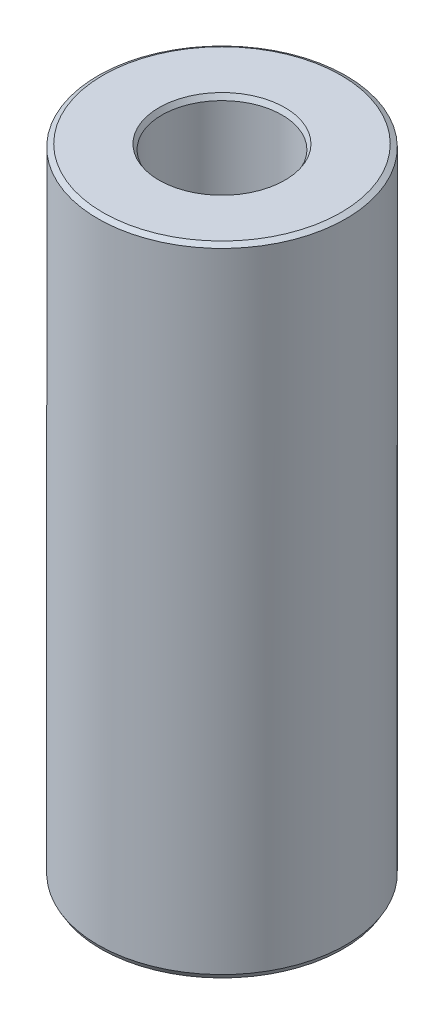
ISO-10303-21;
HEADER;
FILE_DESCRIPTION(('STEP AP214'),'2;1');
FILE_NAME('part.step','',(''),(''),'','','');
FILE_SCHEMA(('AUTOMOTIVE_DESIGN { 1 0 10303 214 1 1 1 1 }'));
ENDSEC;
DATA;
#1=APPLICATION_CONTEXT('core data for automotive mechanical design processes');
#2=APPLICATION_PROTOCOL_DEFINITION('international standard','automotive_design',2000,#1);
#3=PRODUCT_CONTEXT('',#1,'mechanical');
#4=PRODUCT('Part','Part','',(#3));
#5=PRODUCT_RELATED_PRODUCT_CATEGORY('part','',(#4));
#6=PRODUCT_DEFINITION_FORMATION('','',#4);
#7=PRODUCT_DEFINITION_CONTEXT('part definition',#1,'design');
#8=PRODUCT_DEFINITION('design','',#6,#7);
#9=PRODUCT_DEFINITION_SHAPE('','',#8);
#10=(LENGTH_UNIT() NAMED_UNIT(*) SI_UNIT(.MILLI.,.METRE.));
#11=(NAMED_UNIT(*) PLANE_ANGLE_UNIT() SI_UNIT($,.RADIAN.));
#12=(NAMED_UNIT(*) SI_UNIT($,.STERADIAN.) SOLID_ANGLE_UNIT());
#13=UNCERTAINTY_MEASURE_WITH_UNIT(LENGTH_MEASURE(1.E-05),#10,'distance_accuracy_value','');
#14=(GEOMETRIC_REPRESENTATION_CONTEXT(3) GLOBAL_UNCERTAINTY_ASSIGNED_CONTEXT((#13)) GLOBAL_UNIT_ASSIGNED_CONTEXT((#10,
#11,#12)) REPRESENTATION_CONTEXT('',''));
#15=CARTESIAN_POINT('',(0.,0.,0.));
#16=DIRECTION('',(0.,0.,1.));
#17=DIRECTION('',(1.,0.,0.));
#18=AXIS2_PLACEMENT_3D('',#15,#16,#17);
#19=CARTESIAN_POINT('',(0.,231.123114335385,0.));
#20=DIRECTION('',(0.,-1.,0.));
#21=DIRECTION('',(0.,0.,-1.));
#22=AXIS2_PLACEMENT_3D('',#19,#20,#21);
#23=CYLINDRICAL_SURFACE('',#22,45.);
#24=CARTESIAN_POINT('',(0.,1.80662762929526,0.));
#25=DIRECTION('',(0.,1.,0.));
#26=DIRECTION('',(0.,0.,1.));
#27=AXIS2_PLACEMENT_3D('',#24,#25,#26);
#28=CIRCLE('',#27,45.);
#29=CARTESIAN_POINT('',(0.,1.80662762929526,45.));
#30=VERTEX_POINT('',#29);
#31=EDGE_CURVE('E10',#30,#30,#28,.T.);
#32=ORIENTED_EDGE('',*,*,#31,.T.);
#33=EDGE_LOOP('',(#32));
#34=FACE_BOUND('',#33,.T.);
#35=CARTESIAN_POINT('',(0.,230.080057387286,0.));
#36=DIRECTION('',(0.,1.,0.));
#37=DIRECTION('',(0.,0.,1.));
#38=AXIS2_PLACEMENT_3D('',#35,#36,#37);
#39=CIRCLE('',#38,45.);
#40=CARTESIAN_POINT('',(0.,230.080057387286,-45.));
#41=VERTEX_POINT('',#40);
#42=EDGE_CURVE('E50',#41,#41,#39,.F.);
#43=ORIENTED_EDGE('',*,*,#42,.T.);
#44=EDGE_LOOP('',(#43));
#45=FACE_BOUND('',#44,.T.);
#46=ADVANCED_FACE('F39',(#34,#45),#23,.T.);
#47=CARTESIAN_POINT('',(0.,231.123114335385,0.));
#48=DIRECTION('',(0.,1.,0.));
#49=DIRECTION('',(0.,0.,1.));
#50=AXIS2_PLACEMENT_3D('',#47,#48,#49);
#51=PLANE('',#50);
#52=CARTESIAN_POINT('',(0.,231.123114335385,0.));
#53=DIRECTION('',(0.,1.,0.));
#54=DIRECTION('',(0.,0.,1.));
#55=AXIS2_PLACEMENT_3D('',#52,#53,#54);
#56=CIRCLE('',#55,22.8519212506702);
#57=CARTESIAN_POINT('',(0.,231.123114335385,22.8519212506702));
#58=VERTEX_POINT('',#57);
#59=EDGE_CURVE('E58',#58,#58,#56,.F.);
#60=ORIENTED_EDGE('',*,*,#59,.T.);
#61=EDGE_LOOP('',(#60));
#62=FACE_BOUND('',#61,.T.);
#63=CARTESIAN_POINT('',(0.,231.123114335385,0.));
#64=DIRECTION('',(0.,1.,0.));
#65=DIRECTION('',(0.,0.,1.));
#66=AXIS2_PLACEMENT_3D('',#63,#64,#65);
#67=CIRCLE('',#66,43.1933723707048);
#68=CARTESIAN_POINT('',(0.,231.123114335385,-43.1933723707048));
#69=VERTEX_POINT('',#68);
#70=EDGE_CURVE('E61',#69,#69,#67,.T.);
#71=ORIENTED_EDGE('',*,*,#70,.T.);
#72=EDGE_LOOP('',(#71));
#73=FACE_BOUND('',#72,.T.);
#74=ADVANCED_FACE('F88',(#62,#73),#51,.T.);
#75=CARTESIAN_POINT('',(0.,0.,0.));
#76=DIRECTION('',(0.,1.,0.));
#77=DIRECTION('',(0.,0.,1.));
#78=AXIS2_PLACEMENT_3D('',#75,#76,#77);
#79=PLANE('',#78);
#80=CARTESIAN_POINT('',(0.,0.,0.));
#81=DIRECTION('',(0.,1.,0.));
#82=DIRECTION('',(0.,0.,1.));
#83=AXIS2_PLACEMENT_3D('',#80,#81,#82);
#84=CIRCLE('',#83,23.6154919318664);
#85=CARTESIAN_POINT('',(0.,0.,23.6154919318664));
#86=VERTEX_POINT('',#85);
#87=EDGE_CURVE('E51',#86,#86,#84,.T.);
#88=ORIENTED_EDGE('',*,*,#87,.T.);
#89=EDGE_LOOP('',(#88));
#90=FACE_BOUND('',#89,.T.);
#91=CARTESIAN_POINT('',(0.,0.,0.));
#92=DIRECTION('',(0.,1.,0.));
#93=DIRECTION('',(0.,0.,1.));
#94=AXIS2_PLACEMENT_3D('',#91,#92,#93);
#95=CIRCLE('',#94,43.956943051901);
#96=CARTESIAN_POINT('',(0.,0.,43.956943051901));
#97=VERTEX_POINT('',#96);
#98=EDGE_CURVE('E54',#97,#97,#95,.F.);
#99=ORIENTED_EDGE('',*,*,#98,.T.);
#100=EDGE_LOOP('',(#99));
#101=FACE_BOUND('',#100,.T.);
#102=ADVANCED_FACE('F83',(#90,#101),#79,.F.);
#103=CARTESIAN_POINT('',(0.,231.123114335385,0.));
#104=DIRECTION('',(0.,-1.,0.));
#105=DIRECTION('',(0.,0.,-1.));
#106=AXIS2_PLACEMENT_3D('',#103,#104,#105);
#107=CYLINDRICAL_SURFACE('',#106,21.8088643025711);
#108=CARTESIAN_POINT('',(0.,229.316486706089,0.));
#109=DIRECTION('',(0.,1.,0.));
#110=DIRECTION('',(0.,0.,1.));
#111=AXIS2_PLACEMENT_3D('',#108,#109,#110);
#112=CIRCLE('',#111,21.8088643025711);
#113=CARTESIAN_POINT('',(0.,229.316486706089,21.8088643025711));
#114=VERTEX_POINT('',#113);
#115=EDGE_CURVE('E67',#114,#114,#112,.T.);
#116=ORIENTED_EDGE('',*,*,#115,.T.);
#117=EDGE_LOOP('',(#116));
#118=FACE_BOUND('',#117,.T.);
#119=CARTESIAN_POINT('',(0.,1.043056948099,0.));
#120=DIRECTION('',(0.,1.,0.));
#121=DIRECTION('',(0.,0.,1.));
#122=AXIS2_PLACEMENT_3D('',#119,#120,#121);
#123=CIRCLE('',#122,21.8088643025711);
#124=CARTESIAN_POINT('',(0.,1.043056948099,21.8088643025711));
#125=VERTEX_POINT('',#124);
#126=EDGE_CURVE('E69',#125,#125,#123,.F.);
#127=ORIENTED_EDGE('',*,*,#126,.T.);
#128=EDGE_LOOP('',(#127));
#129=FACE_BOUND('',#128,.T.);
#130=ADVANCED_FACE('F71',(#118,#129),#107,.F.);
#131=CARTESIAN_POINT('',(0.,229.316486706089,0.));
#132=DIRECTION('',(0.,1.,0.));
#133=DIRECTION('',(0.,0.,1.));
#134=AXIS2_PLACEMENT_3D('',#131,#132,#133);
#135=CONICAL_SURFACE('',#134,21.8088643025711,0.523598775598294);
#136=ORIENTED_EDGE('',*,*,#59,.F.);
#137=EDGE_LOOP('',(#136));
#138=FACE_BOUND('',#137,.T.);
#139=ORIENTED_EDGE('',*,*,#115,.F.);
#140=EDGE_LOOP('',(#139));
#141=FACE_BOUND('',#140,.T.);
#142=ADVANCED_FACE('F77',(#138,#141),#135,.F.);
#143=CARTESIAN_POINT('',(0.,0.,0.));
#144=DIRECTION('',(0.,-1.,0.));
#145=DIRECTION('',(0.,0.,-1.));
#146=AXIS2_PLACEMENT_3D('',#143,#144,#145);
#147=CONICAL_SURFACE('',#146,23.6154919318664,1.0471975511966);
#148=ORIENTED_EDGE('',*,*,#126,.F.);
#149=EDGE_LOOP('',(#148));
#150=FACE_BOUND('',#149,.T.);
#151=ORIENTED_EDGE('',*,*,#87,.F.);
#152=EDGE_LOOP('',(#151));
#153=FACE_BOUND('',#152,.T.);
#154=ADVANCED_FACE('F73',(#150,#153),#147,.F.);
#155=CARTESIAN_POINT('',(0.,1.80662762929526,0.));
#156=DIRECTION('',(0.,1.,0.));
#157=DIRECTION('',(0.,0.,1.));
#158=AXIS2_PLACEMENT_3D('',#155,#156,#157);
#159=CONICAL_SURFACE('',#158,45.,0.5235987755983);
#160=ORIENTED_EDGE('',*,*,#98,.F.);
#161=EDGE_LOOP('',(#160));
#162=FACE_BOUND('',#161,.T.);
#163=ORIENTED_EDGE('',*,*,#31,.F.);
#164=EDGE_LOOP('',(#163));
#165=FACE_BOUND('',#164,.T.);
#166=ADVANCED_FACE('F76',(#162,#165),#159,.T.);
#167=CARTESIAN_POINT('',(0.,231.123114335385,0.));
#168=DIRECTION('',(0.,-1.,0.));
#169=DIRECTION('',(0.,0.,-1.));
#170=AXIS2_PLACEMENT_3D('',#167,#168,#169);
#171=CONICAL_SURFACE('',#170,43.1933723707048,1.04719755119659);
#172=CARTESIAN_POINT('',(0.,230.080057387286,-45.));
#173=CARTESIAN_POINT('',(0.,230.090922563828,-44.9811809621949));
#174=CARTESIAN_POINT('',(0.,230.101787740371,-44.9623619243897));
#175=CARTESIAN_POINT('',(0.,230.123518093456,-44.9247238487794));
#176=CARTESIAN_POINT('',(0.,230.134383269999,-44.9059048109742));
#177=CARTESIAN_POINT('',(0.,230.156113623085,-44.8682667353639));
#178=CARTESIAN_POINT('',(0.,230.166978799627,-44.8494476975588));
#179=CARTESIAN_POINT('',(0.,230.188709152713,-44.8118096219484));
#180=CARTESIAN_POINT('',(0.,230.199574329255,-44.7929905841433));
#181=CARTESIAN_POINT('',(0.,230.221304682341,-44.755352508533));
#182=CARTESIAN_POINT('',(0.,230.232169858883,-44.7365334707278));
#183=CARTESIAN_POINT('',(0.,230.253900211969,-44.6988953951175));
#184=CARTESIAN_POINT('',(0.,230.264765388512,-44.6800763573123));
#185=CARTESIAN_POINT('',(0.,230.286495741597,-44.642438281702));
#186=CARTESIAN_POINT('',(0.,230.29736091814,-44.6236192438969));
#187=CARTESIAN_POINT('',(0.,230.319091271225,-44.5859811682865));
#188=CARTESIAN_POINT('',(0.,230.329956447768,-44.5671621304814));
#189=CARTESIAN_POINT('',(0.,230.351686800853,-44.5295240548711));
#190=CARTESIAN_POINT('',(0.,230.362551977396,-44.5107050170659));
#191=CARTESIAN_POINT('',(0.,230.384282330481,-44.4730669414556));
#192=CARTESIAN_POINT('',(0.,230.395147507024,-44.4542479036504));
#193=CARTESIAN_POINT('',(0.,230.416877860109,-44.4166098280401));
#194=CARTESIAN_POINT('',(0.,230.427743036652,-44.397790790235));
#195=CARTESIAN_POINT('',(0.,230.449473389737,-44.3601527146246));
#196=CARTESIAN_POINT('',(0.,230.46033856628,-44.3413336768195));
#197=CARTESIAN_POINT('',(0.,230.482068919366,-44.3036956012092));
#198=CARTESIAN_POINT('',(0.,230.492934095908,-44.284876563404));
#199=CARTESIAN_POINT('',(0.,230.514664448994,-44.2472384877937));
#200=CARTESIAN_POINT('',(0.,230.525529625536,-44.2284194499885));
#201=CARTESIAN_POINT('',(0.,230.547259978622,-44.1907813743782));
#202=CARTESIAN_POINT('',(0.,230.558125155164,-44.1719623365731));
#203=CARTESIAN_POINT('',(0.,230.57985550825,-44.1343242609627));
#204=CARTESIAN_POINT('',(0.,230.590720684793,-44.1155052231576));
#205=CARTESIAN_POINT('',(0.,230.612451037878,-44.0778671475473));
#206=CARTESIAN_POINT('',(0.,230.623316214421,-44.0590481097421));
#207=CARTESIAN_POINT('',(0.,230.645046567506,-44.0214100341318));
#208=CARTESIAN_POINT('',(0.,230.655911744049,-44.0025909963266));
#209=CARTESIAN_POINT('',(0.,230.677642097134,-43.9649529207163));
#210=CARTESIAN_POINT('',(0.,230.688507273677,-43.9461338829111));
#211=CARTESIAN_POINT('',(0.,230.710237626762,-43.9084958073008));
#212=CARTESIAN_POINT('',(0.,230.721102803305,-43.8896767694957));
#213=CARTESIAN_POINT('',(0.,230.74283315639,-43.8520386938854));
#214=CARTESIAN_POINT('',(0.,230.753698332933,-43.8332196560802));
#215=CARTESIAN_POINT('',(0.,230.775428686018,-43.7955815804699));
#216=CARTESIAN_POINT('',(0.,230.786293862561,-43.7767625426647));
#217=CARTESIAN_POINT('',(0.,230.808024215646,-43.7391244670544));
#218=CARTESIAN_POINT('',(0.,230.818889392189,-43.7203054292492));
#219=CARTESIAN_POINT('',(0.,230.840619745275,-43.6826673536389));
#220=CARTESIAN_POINT('',(0.,230.851484921817,-43.6638483158338));
#221=CARTESIAN_POINT('',(0.,230.873215274903,-43.6262102402235));
#222=CARTESIAN_POINT('',(0.,230.884080451445,-43.6073912024183));
#223=CARTESIAN_POINT('',(0.,230.905810804531,-43.569753126808));
#224=CARTESIAN_POINT('',(0.,230.916675981073,-43.5509340890028));
#225=CARTESIAN_POINT('',(0.,230.938406334159,-43.5132960133925));
#226=CARTESIAN_POINT('',(0.,230.949271510702,-43.4944769755873));
#227=CARTESIAN_POINT('',(0.,230.971001863787,-43.456838899977));
#228=CARTESIAN_POINT('',(0.,230.98186704033,-43.4380198621719));
#229=CARTESIAN_POINT('',(0.,231.003597393415,-43.4003817865615));
#230=CARTESIAN_POINT('',(0.,231.014462569958,-43.3815627487564));
#231=CARTESIAN_POINT('',(0.,231.036192923043,-43.3439246731461));
#232=CARTESIAN_POINT('',(0.,231.047058099586,-43.3251056353409));
#233=CARTESIAN_POINT('',(0.,231.068788452671,-43.2874675597306));
#234=CARTESIAN_POINT('',(0.,231.079653629214,-43.2686485219254));
#235=CARTESIAN_POINT('',(0.,231.101383982299,-43.2310104463151));
#236=CARTESIAN_POINT('',(0.,231.112249158842,-43.21219140851));
#237=CARTESIAN_POINT('',(0.,231.123114335385,-43.1933723707048));
#238=B_SPLINE_CURVE_WITH_KNOTS('',3,(#172,#173,#174,#175,#176,#177,#178,#179,#180,#181,#182,
#183,#184,#185,#186,#187,#188,#189,#190,#191,#192,#193,#194,#195,#196,#197,#198,#199,#200,#201,
#202,#203,#204,#205,#206,#207,#208,#209,#210,#211,#212,#213,#214,#215,#216,#217,#218,#219,#220,
#221,#222,#223,#224,#225,#226,#227,#228,#229,#230,#231,#232,#233,#234,#235,#236,#237),
.UNSPECIFIED.,.F.,.F.,(4,2,2,2,2,2,2,2,2,2,2,2,2,2,2,2,2,2,2,2,2,2,2,2,2,2,2,2,2,2,2,2,4),(0.,
0.0651910592562037,0.130382118512388,0.195573177768571,0.260764237024755,0.325955296280959,
0.391146355537143,0.456337414793327,0.52152847404951,0.586719533305708,0.651910592561898,
0.717101651818082,0.782292711074266,0.847483770330464,0.912674829586653,0.977865888842837,
1.04305694809902,1.10824800735522,1.1734390666114,1.23863012586759,1.30382118512378,
1.36901224437997,1.43420330363616,1.49939436289235,1.56458542214853,1.62977648140473,
1.69496754066091,1.7601585999171,1.8253496591733,1.89054071842948,1.95573177768567,
2.02092283694185,2.08611389619805),.UNSPECIFIED.);
#239=EDGE_CURVE('BSEAM45',#41,#69,#238,.T.);
#240=ORIENTED_EDGE('',*,*,#42,.F.);
#241=ORIENTED_EDGE('',*,*,#70,.F.);
#242=ORIENTED_EDGE('',*,*,#239,.T.);
#243=ORIENTED_EDGE('',*,*,#239,.F.);
#244=EDGE_LOOP('',(#240,#242,#241,#243));
#245=FACE_BOUND('',#244,.T.);
#246=ADVANCED_FACE('F45',(#245),#171,.T.);
#247=CLOSED_SHELL('',(#46,#74,#102,#130,#142,#154,#166,#246));
#248=MANIFOLD_SOLID_BREP('B2',#247);
#249=ADVANCED_BREP_SHAPE_REPRESENTATION('',(#18,#248),#14);
#250=SHAPE_DEFINITION_REPRESENTATION(#9,#249);
ENDSEC;
END-ISO-10303-21;
